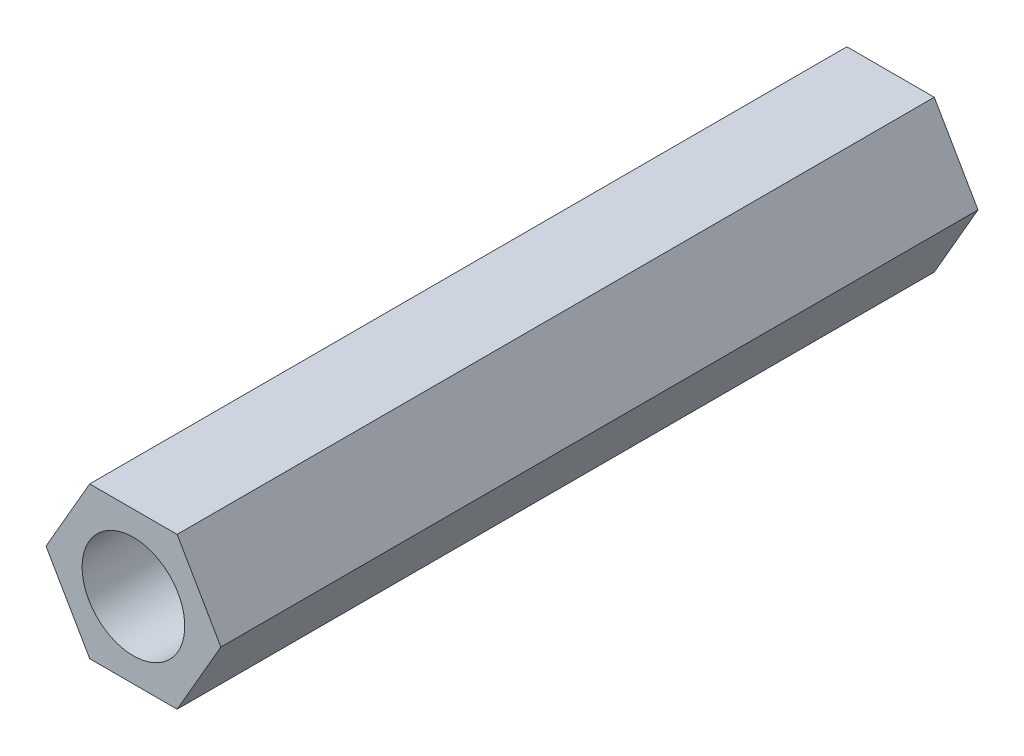
ISO-10303-21;
HEADER;
FILE_DESCRIPTION(('STEP AP214'),'2;1');
FILE_NAME('part.step','',(''),(''),'','','');
FILE_SCHEMA(('AUTOMOTIVE_DESIGN { 1 0 10303 214 1 1 1 1 }'));
ENDSEC;
DATA;
#1=APPLICATION_CONTEXT('core data for automotive mechanical design processes');
#2=APPLICATION_PROTOCOL_DEFINITION('international standard','automotive_design',2000,#1);
#3=PRODUCT_CONTEXT('',#1,'mechanical');
#4=PRODUCT('Part','Part','',(#3));
#5=PRODUCT_RELATED_PRODUCT_CATEGORY('part','',(#4));
#6=PRODUCT_DEFINITION_FORMATION('','',#4);
#7=PRODUCT_DEFINITION_CONTEXT('part definition',#1,'design');
#8=PRODUCT_DEFINITION('design','',#6,#7);
#9=PRODUCT_DEFINITION_SHAPE('','',#8);
#10=(LENGTH_UNIT() NAMED_UNIT(*) SI_UNIT(.MILLI.,.METRE.));
#11=(NAMED_UNIT(*) PLANE_ANGLE_UNIT() SI_UNIT($,.RADIAN.));
#12=(NAMED_UNIT(*) SI_UNIT($,.STERADIAN.) SOLID_ANGLE_UNIT());
#13=UNCERTAINTY_MEASURE_WITH_UNIT(LENGTH_MEASURE(1.E-05),#10,'distance_accuracy_value','');
#14=(GEOMETRIC_REPRESENTATION_CONTEXT(3) GLOBAL_UNCERTAINTY_ASSIGNED_CONTEXT((#13)) GLOBAL_UNIT_ASSIGNED_CONTEXT((#10,
#11,#12)) REPRESENTATION_CONTEXT('',''));
#15=CARTESIAN_POINT('',(0.,0.,0.));
#16=DIRECTION('',(0.,0.,1.));
#17=DIRECTION('',(1.,0.,0.));
#18=AXIS2_PLACEMENT_3D('',#15,#16,#17);
#19=CARTESIAN_POINT('',(1.83308710467706,-3.175,15.875));
#20=DIRECTION('',(-0.866025403784439,0.5,0.));
#21=DIRECTION('',(-0.5,-0.866025403784439,0.));
#22=AXIS2_PLACEMENT_3D('',#19,#20,#21);
#23=PLANE('',#22);
#24=DIRECTION('',(0.,0.,1.));
#25=VECTOR('',#24,1.);
#26=CARTESIAN_POINT('',(3.66617420935412,0.,15.875));
#27=LINE('',#26,#25);
#28=CARTESIAN_POINT('',(3.66617420935412,0.,-15.875));
#29=VERTEX_POINT('',#28);
#30=CARTESIAN_POINT('',(3.66617420935412,0.,15.875));
#31=VERTEX_POINT('',#30);
#32=EDGE_CURVE('E66',#29,#31,#27,.T.);
#33=ORIENTED_EDGE('',*,*,#32,.T.);
#34=DIRECTION('',(0.5,0.866025403784439,0.));
#35=VECTOR('',#34,1.);
#36=CARTESIAN_POINT('',(1.83308710467706,-3.175,15.875));
#37=LINE('',#36,#35);
#38=CARTESIAN_POINT('',(1.83308710467706,-3.175,15.875));
#39=VERTEX_POINT('',#38);
#40=EDGE_CURVE('E106',#39,#31,#37,.T.);
#41=ORIENTED_EDGE('',*,*,#40,.F.);
#42=DIRECTION('',(0.,0.,1.));
#43=VECTOR('',#42,1.);
#44=CARTESIAN_POINT('',(1.83308710467706,-3.175,15.875));
#45=LINE('',#44,#43);
#46=CARTESIAN_POINT('',(1.83308710467706,-3.175,-15.875));
#47=VERTEX_POINT('',#46);
#48=EDGE_CURVE('E93',#39,#47,#45,.F.);
#49=ORIENTED_EDGE('',*,*,#48,.T.);
#50=DIRECTION('',(0.5,0.866025403784439,0.));
#51=VECTOR('',#50,1.);
#52=CARTESIAN_POINT('',(1.83308710467706,-3.175,-15.875));
#53=LINE('',#52,#51);
#54=EDGE_CURVE('E107',#47,#29,#53,.T.);
#55=ORIENTED_EDGE('',*,*,#54,.T.);
#56=EDGE_LOOP('',(#33,#41,#49,#55));
#57=FACE_BOUND('',#56,.T.);
#58=ADVANCED_FACE('F17',(#57),#23,.F.);
#59=CARTESIAN_POINT('',(3.66617420935412,0.,15.875));
#60=DIRECTION('',(-0.866025403784439,-0.5,0.));
#61=DIRECTION('',(0.5,-0.866025403784439,0.));
#62=AXIS2_PLACEMENT_3D('',#59,#60,#61);
#63=PLANE('',#62);
#64=DIRECTION('',(0.,0.,1.));
#65=VECTOR('',#64,1.);
#66=CARTESIAN_POINT('',(1.83308710467705,3.175,15.875));
#67=LINE('',#66,#65);
#68=CARTESIAN_POINT('',(1.83308710467705,3.175,-15.875));
#69=VERTEX_POINT('',#68);
#70=CARTESIAN_POINT('',(1.83308710467705,3.175,15.875));
#71=VERTEX_POINT('',#70);
#72=EDGE_CURVE('E73',#69,#71,#67,.T.);
#73=ORIENTED_EDGE('',*,*,#72,.T.);
#74=DIRECTION('',(-0.5,0.866025403784439,0.));
#75=VECTOR('',#74,1.);
#76=CARTESIAN_POINT('',(3.66617420935412,0.,15.875));
#77=LINE('',#76,#75);
#78=EDGE_CURVE('E108',#31,#71,#77,.T.);
#79=ORIENTED_EDGE('',*,*,#78,.F.);
#80=ORIENTED_EDGE('',*,*,#32,.F.);
#81=DIRECTION('',(-0.5,0.866025403784439,0.));
#82=VECTOR('',#81,1.);
#83=CARTESIAN_POINT('',(3.66617420935412,0.,-15.875));
#84=LINE('',#83,#82);
#85=EDGE_CURVE('E86',#29,#69,#84,.T.);
#86=ORIENTED_EDGE('',*,*,#85,.T.);
#87=EDGE_LOOP('',(#73,#79,#80,#86));
#88=FACE_BOUND('',#87,.T.);
#89=ADVANCED_FACE('F92',(#88),#63,.F.);
#90=CARTESIAN_POINT('',(1.83308710467705,3.175,15.875));
#91=DIRECTION('',(0.,-1.,0.));
#92=DIRECTION('',(1.,0.,0.));
#93=AXIS2_PLACEMENT_3D('',#90,#91,#92);
#94=PLANE('',#93);
#95=DIRECTION('',(0.,0.,1.));
#96=VECTOR('',#95,1.);
#97=CARTESIAN_POINT('',(-1.83308710467706,3.175,15.875));
#98=LINE('',#97,#96);
#99=CARTESIAN_POINT('',(-1.83308710467706,3.175,-15.875));
#100=VERTEX_POINT('',#99);
#101=CARTESIAN_POINT('',(-1.83308710467706,3.175,15.875));
#102=VERTEX_POINT('',#101);
#103=EDGE_CURVE('E79',#100,#102,#98,.T.);
#104=ORIENTED_EDGE('',*,*,#103,.T.);
#105=DIRECTION('',(1.,0.,0.));
#106=VECTOR('',#105,1.);
#107=CARTESIAN_POINT('',(3.66617420935412,3.175,15.875));
#108=LINE('',#107,#106);
#109=EDGE_CURVE('E78',#71,#102,#108,.F.);
#110=ORIENTED_EDGE('',*,*,#109,.F.);
#111=ORIENTED_EDGE('',*,*,#72,.F.);
#112=DIRECTION('',(1.,0.,0.));
#113=VECTOR('',#112,1.);
#114=CARTESIAN_POINT('',(3.66617420935412,3.175,-15.875));
#115=LINE('',#114,#113);
#116=EDGE_CURVE('E77',#69,#100,#115,.F.);
#117=ORIENTED_EDGE('',*,*,#116,.T.);
#118=EDGE_LOOP('',(#104,#110,#111,#117));
#119=FACE_BOUND('',#118,.T.);
#120=ADVANCED_FACE('F76',(#119),#94,.F.);
#121=CARTESIAN_POINT('',(-1.83308710467706,3.175,15.875));
#122=DIRECTION('',(0.866025403784439,-0.5,0.));
#123=DIRECTION('',(0.5,0.866025403784439,0.));
#124=AXIS2_PLACEMENT_3D('',#121,#122,#123);
#125=PLANE('',#124);
#126=DIRECTION('',(0.,0.,1.));
#127=VECTOR('',#126,1.);
#128=CARTESIAN_POINT('',(-3.66617420935413,0.,15.875));
#129=LINE('',#128,#127);
#130=CARTESIAN_POINT('',(-3.66617420935413,0.,-15.875));
#131=VERTEX_POINT('',#130);
#132=CARTESIAN_POINT('',(-3.66617420935413,0.,15.875));
#133=VERTEX_POINT('',#132);
#134=EDGE_CURVE('E100',#131,#133,#129,.T.);
#135=ORIENTED_EDGE('',*,*,#134,.T.);
#136=DIRECTION('',(-0.5,-0.866025403784439,0.));
#137=VECTOR('',#136,1.);
#138=CARTESIAN_POINT('',(-1.83308710467706,3.175,15.875));
#139=LINE('',#138,#137);
#140=EDGE_CURVE('E110',#102,#133,#139,.T.);
#141=ORIENTED_EDGE('',*,*,#140,.F.);
#142=ORIENTED_EDGE('',*,*,#103,.F.);
#143=DIRECTION('',(-0.5,-0.866025403784439,0.));
#144=VECTOR('',#143,1.);
#145=CARTESIAN_POINT('',(-1.83308710467706,3.175,-15.875));
#146=LINE('',#145,#144);
#147=EDGE_CURVE('E90',#100,#131,#146,.T.);
#148=ORIENTED_EDGE('',*,*,#147,.T.);
#149=EDGE_LOOP('',(#135,#141,#142,#148));
#150=FACE_BOUND('',#149,.T.);
#151=ADVANCED_FACE('F122',(#150),#125,.F.);
#152=CARTESIAN_POINT('',(-3.66617420935413,0.,15.875));
#153=DIRECTION('',(0.866025403784439,0.5,0.));
#154=DIRECTION('',(-0.5,0.866025403784439,0.));
#155=AXIS2_PLACEMENT_3D('',#152,#153,#154);
#156=PLANE('',#155);
#157=DIRECTION('',(0.,0.,1.));
#158=VECTOR('',#157,1.);
#159=CARTESIAN_POINT('',(-1.83308710467707,-3.175,15.875));
#160=LINE('',#159,#158);
#161=CARTESIAN_POINT('',(-1.83308710467707,-3.175,-15.875));
#162=VERTEX_POINT('',#161);
#163=CARTESIAN_POINT('',(-1.83308710467707,-3.175,15.875));
#164=VERTEX_POINT('',#163);
#165=EDGE_CURVE('E95',#162,#164,#160,.T.);
#166=ORIENTED_EDGE('',*,*,#165,.T.);
#167=DIRECTION('',(0.5,-0.866025403784439,0.));
#168=VECTOR('',#167,1.);
#169=CARTESIAN_POINT('',(-3.66617420935413,0.,15.875));
#170=LINE('',#169,#168);
#171=EDGE_CURVE('E33',#133,#164,#170,.T.);
#172=ORIENTED_EDGE('',*,*,#171,.F.);
#173=ORIENTED_EDGE('',*,*,#134,.F.);
#174=DIRECTION('',(0.5,-0.866025403784439,0.));
#175=VECTOR('',#174,1.);
#176=CARTESIAN_POINT('',(-3.66617420935413,0.,-15.875));
#177=LINE('',#176,#175);
#178=EDGE_CURVE('E119',#131,#162,#177,.T.);
#179=ORIENTED_EDGE('',*,*,#178,.T.);
#180=EDGE_LOOP('',(#166,#172,#173,#179));
#181=FACE_BOUND('',#180,.T.);
#182=ADVANCED_FACE('F150',(#181),#156,.F.);
#183=CARTESIAN_POINT('',(-1.83308710467707,-3.175,15.875));
#184=DIRECTION('',(0.,1.,0.));
#185=DIRECTION('',(-1.,0.,0.));
#186=AXIS2_PLACEMENT_3D('',#183,#184,#185);
#187=PLANE('',#186);
#188=ORIENTED_EDGE('',*,*,#48,.F.);
#189=DIRECTION('',(1.,0.,0.));
#190=VECTOR('',#189,1.);
#191=CARTESIAN_POINT('',(3.66617420935412,-3.175,15.875));
#192=LINE('',#191,#190);
#193=EDGE_CURVE('E124',#164,#39,#192,.T.);
#194=ORIENTED_EDGE('',*,*,#193,.F.);
#195=ORIENTED_EDGE('',*,*,#165,.F.);
#196=DIRECTION('',(1.,0.,0.));
#197=VECTOR('',#196,1.);
#198=CARTESIAN_POINT('',(3.66617420935412,-3.175,-15.875));
#199=LINE('',#198,#197);
#200=EDGE_CURVE('E116',#162,#47,#199,.T.);
#201=ORIENTED_EDGE('',*,*,#200,.T.);
#202=EDGE_LOOP('',(#188,#194,#195,#201));
#203=FACE_BOUND('',#202,.T.);
#204=ADVANCED_FACE('F145',(#203),#187,.F.);
#205=CARTESIAN_POINT('',(3.66617420935412,0.,-15.875));
#206=DIRECTION('',(0.,0.,1.));
#207=DIRECTION('',(1.,0.,0.));
#208=AXIS2_PLACEMENT_3D('',#205,#206,#207);
#209=PLANE('',#208);
#210=CARTESIAN_POINT('',(0.,0.,-15.875));
#211=DIRECTION('',(0.,0.,-1.));
#212=DIRECTION('',(-1.,0.,0.));
#213=AXIS2_PLACEMENT_3D('',#210,#211,#212);
#214=CIRCLE('',#213,2.15265);
#215=CARTESIAN_POINT('',(-2.15265,0.,-15.875));
#216=VERTEX_POINT('',#215);
#217=EDGE_CURVE('E20',#216,#216,#214,.F.);
#218=ORIENTED_EDGE('',*,*,#217,.T.);
#219=EDGE_LOOP('',(#218));
#220=FACE_BOUND('',#219,.T.);
#221=ORIENTED_EDGE('',*,*,#200,.F.);
#222=ORIENTED_EDGE('',*,*,#178,.F.);
#223=ORIENTED_EDGE('',*,*,#147,.F.);
#224=ORIENTED_EDGE('',*,*,#116,.F.);
#225=ORIENTED_EDGE('',*,*,#85,.F.);
#226=ORIENTED_EDGE('',*,*,#54,.F.);
#227=EDGE_LOOP('',(#221,#222,#223,#224,#225,#226));
#228=FACE_BOUND('',#227,.T.);
#229=ADVANCED_FACE('F84',(#220,#228),#209,.F.);
#230=CARTESIAN_POINT('',(3.66617420935412,0.,15.875));
#231=DIRECTION('',(0.,0.,1.));
#232=DIRECTION('',(1.,0.,0.));
#233=AXIS2_PLACEMENT_3D('',#230,#231,#232);
#234=PLANE('',#233);
#235=CARTESIAN_POINT('',(0.,0.,15.875));
#236=DIRECTION('',(0.,0.,-1.));
#237=DIRECTION('',(-1.,0.,0.));
#238=AXIS2_PLACEMENT_3D('',#235,#236,#237);
#239=CIRCLE('',#238,2.15265);
#240=CARTESIAN_POINT('',(-2.15265,0.,15.875));
#241=VERTEX_POINT('',#240);
#242=EDGE_CURVE('E11',#241,#241,#239,.T.);
#243=ORIENTED_EDGE('',*,*,#242,.T.);
#244=EDGE_LOOP('',(#243));
#245=FACE_BOUND('',#244,.T.);
#246=ORIENTED_EDGE('',*,*,#171,.T.);
#247=ORIENTED_EDGE('',*,*,#193,.T.);
#248=ORIENTED_EDGE('',*,*,#40,.T.);
#249=ORIENTED_EDGE('',*,*,#78,.T.);
#250=ORIENTED_EDGE('',*,*,#109,.T.);
#251=ORIENTED_EDGE('',*,*,#140,.T.);
#252=EDGE_LOOP('',(#246,#247,#248,#249,#250,#251));
#253=FACE_BOUND('',#252,.T.);
#254=ADVANCED_FACE('F135',(#245,#253),#234,.T.);
#255=CARTESIAN_POINT('',(0.,0.,15.875));
#256=DIRECTION('',(0.,0.,-1.));
#257=DIRECTION('',(-1.,0.,0.));
#258=AXIS2_PLACEMENT_3D('',#255,#256,#257);
#259=CYLINDRICAL_SURFACE('',#258,2.15265);
#260=ORIENTED_EDGE('',*,*,#217,.F.);
#261=EDGE_LOOP('',(#260));
#262=FACE_BOUND('',#261,.T.);
#263=ORIENTED_EDGE('',*,*,#242,.F.);
#264=EDGE_LOOP('',(#263));
#265=FACE_BOUND('',#264,.T.);
#266=ADVANCED_FACE('F132',(#262,#265),#259,.F.);
#267=CLOSED_SHELL('',(#58,#89,#120,#151,#182,#204,#229,#254,#266));
#268=MANIFOLD_SOLID_BREP('B1',#267);
#269=ADVANCED_BREP_SHAPE_REPRESENTATION('',(#18,#268),#14);
#270=SHAPE_DEFINITION_REPRESENTATION(#9,#269);
ENDSEC;
END-ISO-10303-21;
